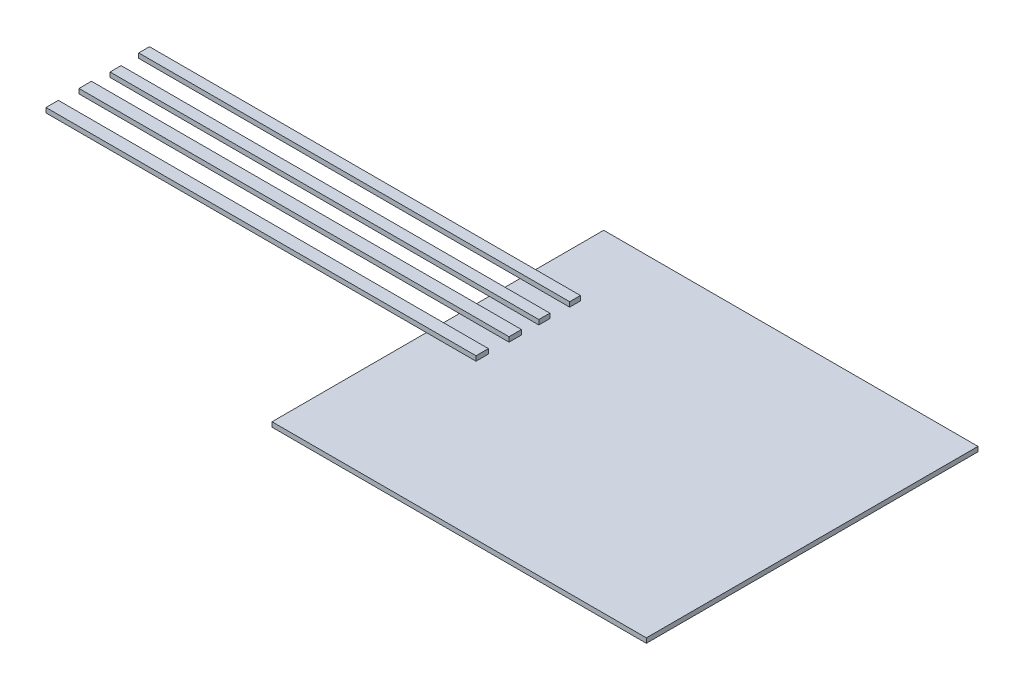
ISO-10303-21;
HEADER;
FILE_DESCRIPTION(('STEP AP214'),'2;1');
FILE_NAME('part.step','',(''),(''),'','','');
FILE_SCHEMA(('AUTOMOTIVE_DESIGN { 1 0 10303 214 1 1 1 1 }'));
ENDSEC;
DATA;
#1=APPLICATION_CONTEXT('core data for automotive mechanical design processes');
#2=APPLICATION_PROTOCOL_DEFINITION('international standard','automotive_design',2000,#1);
#3=PRODUCT_CONTEXT('',#1,'mechanical');
#4=PRODUCT('Part','Part','',(#3));
#5=PRODUCT_RELATED_PRODUCT_CATEGORY('part','',(#4));
#6=PRODUCT_DEFINITION_FORMATION('','',#4);
#7=PRODUCT_DEFINITION_CONTEXT('part definition',#1,'design');
#8=PRODUCT_DEFINITION('design','',#6,#7);
#9=PRODUCT_DEFINITION_SHAPE('','',#8);
#10=(LENGTH_UNIT() NAMED_UNIT(*) SI_UNIT(.MILLI.,.METRE.));
#11=(NAMED_UNIT(*) PLANE_ANGLE_UNIT() SI_UNIT($,.RADIAN.));
#12=(NAMED_UNIT(*) SI_UNIT($,.STERADIAN.) SOLID_ANGLE_UNIT());
#13=UNCERTAINTY_MEASURE_WITH_UNIT(LENGTH_MEASURE(1.E-05),#10,'distance_accuracy_value','');
#14=(GEOMETRIC_REPRESENTATION_CONTEXT(3) GLOBAL_UNCERTAINTY_ASSIGNED_CONTEXT((#13)) GLOBAL_UNIT_ASSIGNED_CONTEXT((#10,
#11,#12)) REPRESENTATION_CONTEXT('',''));
#15=CARTESIAN_POINT('',(0.,0.,0.));
#16=DIRECTION('',(0.,0.,1.));
#17=DIRECTION('',(1.,0.,0.));
#18=AXIS2_PLACEMENT_3D('',#15,#16,#17);
#19=CARTESIAN_POINT('',(-39.9859665766938,0.5,12.9830018030511));
#20=DIRECTION('',(0.,1.,0.));
#21=DIRECTION('',(0.,0.,1.));
#22=AXIS2_PLACEMENT_3D('',#19,#20,#21);
#23=PLANE('',#22);
#24=DIRECTION('',(0.,0.,1.));
#25=VECTOR('',#24,1.);
#26=CARTESIAN_POINT('',(-39.9859665766938,0.5,-22.0169981969489));
#27=LINE('',#26,#25);
#28=CARTESIAN_POINT('',(-39.9859665766938,0.5,-22.0169981969489));
#29=VERTEX_POINT('',#28);
#30=CARTESIAN_POINT('',(-39.9859665766938,0.5,-14.3264205111031));
#31=VERTEX_POINT('',#30);
#32=EDGE_CURVE('E320',#29,#31,#27,.T.);
#33=ORIENTED_EDGE('',*,*,#32,.T.);
#34=DIRECTION('',(-1.,0.,0.));
#35=VECTOR('',#34,1.);
#36=CARTESIAN_POINT('',(-34.7531592675171,0.5,-14.3264205111031));
#37=LINE('',#36,#35);
#38=CARTESIAN_POINT('',(-34.7531592675171,0.5,-14.3264205111031));
#39=VERTEX_POINT('',#38);
#40=EDGE_CURVE('E48',#39,#31,#37,.T.);
#41=ORIENTED_EDGE('',*,*,#40,.F.);
#42=DIRECTION('',(0.,0.,-1.));
#43=VECTOR('',#42,1.);
#44=CARTESIAN_POINT('',(-34.7531592675171,0.5,-13.1931519670227));
#45=LINE('',#44,#43);
#46=CARTESIAN_POINT('',(-34.7531592675171,0.5,-13.1931519670227));
#47=VERTEX_POINT('',#46);
#48=EDGE_CURVE('E53',#47,#39,#45,.T.);
#49=ORIENTED_EDGE('',*,*,#48,.F.);
#50=DIRECTION('',(1.,0.,0.));
#51=VECTOR('',#50,1.);
#52=CARTESIAN_POINT('',(-34.7531592675171,0.5,-13.1931519670227));
#53=LINE('',#52,#51);
#54=CARTESIAN_POINT('',(-39.9859665766938,0.5,-13.1931519670227));
#55=VERTEX_POINT('',#54);
#56=EDGE_CURVE('E396',#55,#47,#53,.T.);
#57=ORIENTED_EDGE('',*,*,#56,.F.);
#58=CARTESIAN_POINT('',(-39.9859665766938,0.5,-11.1012194312207));
#59=VERTEX_POINT('',#58);
#60=EDGE_CURVE('E324',#55,#59,#27,.T.);
#61=ORIENTED_EDGE('',*,*,#60,.T.);
#62=DIRECTION('',(-1.,0.,0.));
#63=VECTOR('',#62,1.);
#64=CARTESIAN_POINT('',(-34.7531592675171,0.5,-11.1012194312207));
#65=LINE('',#64,#63);
#66=CARTESIAN_POINT('',(-34.7531592675171,0.5,-11.1012194312207));
#67=VERTEX_POINT('',#66);
#68=EDGE_CURVE('E236',#67,#59,#65,.T.);
#69=ORIENTED_EDGE('',*,*,#68,.F.);
#70=DIRECTION('',(0.,0.,-1.));
#71=VECTOR('',#70,1.);
#72=CARTESIAN_POINT('',(-34.7531592675171,0.5,-9.93720931208993));
#73=LINE('',#72,#71);
#74=CARTESIAN_POINT('',(-34.7531592675171,0.5,-9.93720931208993));
#75=VERTEX_POINT('',#74);
#76=EDGE_CURVE('E216',#75,#67,#73,.T.);
#77=ORIENTED_EDGE('',*,*,#76,.F.);
#78=DIRECTION('',(1.,0.,0.));
#79=VECTOR('',#78,1.);
#80=CARTESIAN_POINT('',(-34.7531592675171,0.5,-9.93720931208993));
#81=LINE('',#80,#79);
#82=CARTESIAN_POINT('',(-39.9859665766938,0.5,-9.93720931208993));
#83=VERTEX_POINT('',#82);
#84=EDGE_CURVE('E241',#83,#75,#81,.T.);
#85=ORIENTED_EDGE('',*,*,#84,.F.);
#86=CARTESIAN_POINT('',(-39.9859665766938,0.5,-8.10820128942376));
#87=VERTEX_POINT('',#86);
#88=EDGE_CURVE('E382',#83,#87,#27,.T.);
#89=ORIENTED_EDGE('',*,*,#88,.T.);
#90=DIRECTION('',(-1.,0.,0.));
#91=VECTOR('',#90,1.);
#92=CARTESIAN_POINT('',(-34.7531592675171,0.5,-8.10820128942376));
#93=LINE('',#92,#91);
#94=CARTESIAN_POINT('',(-34.7531592675171,0.5,-8.10820128942376));
#95=VERTEX_POINT('',#94);
#96=EDGE_CURVE('E270',#95,#87,#93,.T.);
#97=ORIENTED_EDGE('',*,*,#96,.F.);
#98=DIRECTION('',(0.,0.,-1.));
#99=VECTOR('',#98,1.);
#100=CARTESIAN_POINT('',(-34.7531592675171,0.5,-6.79325301199736));
#101=LINE('',#100,#99);
#102=CARTESIAN_POINT('',(-34.7531592675171,0.5,-6.79325301199736));
#103=VERTEX_POINT('',#102);
#104=EDGE_CURVE('E255',#103,#95,#101,.T.);
#105=ORIENTED_EDGE('',*,*,#104,.F.);
#106=DIRECTION('',(-1.,0.,0.));
#107=VECTOR('',#106,1.);
#108=CARTESIAN_POINT('',(-39.9859665766938,0.5,-6.79325301199736));
#109=LINE('',#108,#107);
#110=CARTESIAN_POINT('',(-39.9859665766938,0.5,-6.79325301199736));
#111=VERTEX_POINT('',#110);
#112=EDGE_CURVE('E11',#103,#111,#109,.T.);
#113=ORIENTED_EDGE('',*,*,#112,.T.);
#114=CARTESIAN_POINT('',(-39.9859665766938,0.5,-4.61650701533452));
#115=VERTEX_POINT('',#114);
#116=EDGE_CURVE('E378',#111,#115,#27,.T.);
#117=ORIENTED_EDGE('',*,*,#116,.T.);
#118=DIRECTION('',(-1.,0.,0.));
#119=VECTOR('',#118,1.);
#120=CARTESIAN_POINT('',(-34.7531592675171,0.5,-4.61650701533452));
#121=LINE('',#120,#119);
#122=CARTESIAN_POINT('',(-34.7531592675171,0.5,-4.61650701533452));
#123=VERTEX_POINT('',#122);
#124=EDGE_CURVE('E301',#123,#115,#121,.T.);
#125=ORIENTED_EDGE('',*,*,#124,.F.);
#126=DIRECTION('',(0.,0.,-1.));
#127=VECTOR('',#126,1.);
#128=CARTESIAN_POINT('',(-34.7531592675171,0.5,-3.31076498617429));
#129=LINE('',#128,#127);
#130=CARTESIAN_POINT('',(-34.7531592675171,0.5,-3.31076498617429));
#131=VERTEX_POINT('',#130);
#132=EDGE_CURVE('E286',#131,#123,#129,.T.);
#133=ORIENTED_EDGE('',*,*,#132,.F.);
#134=DIRECTION('',(1.,0.,0.));
#135=VECTOR('',#134,1.);
#136=CARTESIAN_POINT('',(-34.7531592675171,0.5,-3.31076498617429));
#137=LINE('',#136,#135);
#138=CARTESIAN_POINT('',(-39.9859665766938,0.5,-3.31076498617429));
#139=VERTEX_POINT('',#138);
#140=EDGE_CURVE('E41',#139,#131,#137,.T.);
#141=ORIENTED_EDGE('',*,*,#140,.F.);
#142=CARTESIAN_POINT('',(-39.9859665766938,0.5,12.9830018030511));
#143=VERTEX_POINT('',#142);
#144=EDGE_CURVE('E340',#139,#143,#27,.T.);
#145=ORIENTED_EDGE('',*,*,#144,.T.);
#146=DIRECTION('',(1.,0.,0.));
#147=VECTOR('',#146,1.);
#148=CARTESIAN_POINT('',(-39.9859665766938,0.5,12.9830018030511));
#149=LINE('',#148,#147);
#150=CARTESIAN_POINT('',(-0.485966576693794,0.5,12.9830018030511));
#151=VERTEX_POINT('',#150);
#152=EDGE_CURVE('E322',#143,#151,#149,.T.);
#153=ORIENTED_EDGE('',*,*,#152,.T.);
#154=DIRECTION('',(0.,0.,-1.));
#155=VECTOR('',#154,1.);
#156=CARTESIAN_POINT('',(-0.485966576693801,0.5,-22.0169981969489));
#157=LINE('',#156,#155);
#158=CARTESIAN_POINT('',(-0.485966576693801,0.5,-22.0169981969489));
#159=VERTEX_POINT('',#158);
#160=EDGE_CURVE('E327',#151,#159,#157,.T.);
#161=ORIENTED_EDGE('',*,*,#160,.T.);
#162=DIRECTION('',(-1.,0.,0.));
#163=VECTOR('',#162,1.);
#164=CARTESIAN_POINT('',(-39.9859665766938,0.5,-22.0169981969489));
#165=LINE('',#164,#163);
#166=EDGE_CURVE('E329',#159,#29,#165,.T.);
#167=ORIENTED_EDGE('',*,*,#166,.T.);
#168=EDGE_LOOP('',(#33,#41,#49,#57,#61,#69,#77,#85,#89,#97,#105,#113,#117,#125,#133,#141,#145,
#153,#161,#167));
#169=FACE_BOUND('',#168,.T.);
#170=ADVANCED_FACE('F33',(#169),#23,.T.);
#171=CARTESIAN_POINT('',(-39.9859665766938,0.5,-22.0169981969489));
#172=DIRECTION('',(1.,0.,0.));
#173=DIRECTION('',(0.,0.,-1.));
#174=AXIS2_PLACEMENT_3D('',#171,#172,#173);
#175=PLANE('',#174);
#176=DIRECTION('',(0.,0.,1.));
#177=VECTOR('',#176,1.);
#178=CARTESIAN_POINT('',(-39.9859665766938,0.,-22.0169981969489));
#179=LINE('',#178,#177);
#180=CARTESIAN_POINT('',(-39.9859665766938,0.,-22.0169981969489));
#181=VERTEX_POINT('',#180);
#182=CARTESIAN_POINT('',(-39.9859665766938,0.,12.9830018030511));
#183=VERTEX_POINT('',#182);
#184=EDGE_CURVE('E319',#181,#183,#179,.T.);
#185=ORIENTED_EDGE('',*,*,#184,.T.);
#186=DIRECTION('',(0.,-1.,0.));
#187=VECTOR('',#186,1.);
#188=CARTESIAN_POINT('',(-39.9859665766938,0.5,12.9830018030511));
#189=LINE('',#188,#187);
#190=EDGE_CURVE('E348',#143,#183,#189,.T.);
#191=ORIENTED_EDGE('',*,*,#190,.F.);
#192=ORIENTED_EDGE('',*,*,#144,.F.);
#193=EDGE_CURVE('E325',#115,#139,#27,.T.);
#194=ORIENTED_EDGE('',*,*,#193,.F.);
#195=ORIENTED_EDGE('',*,*,#116,.F.);
#196=EDGE_CURVE('E379',#87,#111,#27,.T.);
#197=ORIENTED_EDGE('',*,*,#196,.F.);
#198=ORIENTED_EDGE('',*,*,#88,.F.);
#199=EDGE_CURVE('E380',#59,#83,#27,.T.);
#200=ORIENTED_EDGE('',*,*,#199,.F.);
#201=ORIENTED_EDGE('',*,*,#60,.F.);
#202=EDGE_CURVE('E323',#31,#55,#27,.T.);
#203=ORIENTED_EDGE('',*,*,#202,.F.);
#204=ORIENTED_EDGE('',*,*,#32,.F.);
#205=DIRECTION('',(0.,-1.,0.));
#206=VECTOR('',#205,1.);
#207=CARTESIAN_POINT('',(-39.9859665766938,0.5,-22.0169981969489));
#208=LINE('',#207,#206);
#209=EDGE_CURVE('E331',#29,#181,#208,.T.);
#210=ORIENTED_EDGE('',*,*,#209,.T.);
#211=EDGE_LOOP('',(#185,#191,#192,#194,#195,#197,#198,#200,#201,#203,#204,#210));
#212=FACE_BOUND('',#211,.T.);
#213=ADVANCED_FACE('F35',(#212),#175,.F.);
#214=CARTESIAN_POINT('',(-39.9859665766938,0.5,12.9830018030511));
#215=DIRECTION('',(0.,0.,-1.));
#216=DIRECTION('',(-1.,0.,0.));
#217=AXIS2_PLACEMENT_3D('',#214,#215,#216);
#218=PLANE('',#217);
#219=DIRECTION('',(1.,0.,0.));
#220=VECTOR('',#219,1.);
#221=CARTESIAN_POINT('',(-39.9859665766938,0.,12.9830018030511));
#222=LINE('',#221,#220);
#223=CARTESIAN_POINT('',(-0.485966576693794,0.,12.9830018030511));
#224=VERTEX_POINT('',#223);
#225=EDGE_CURVE('E334',#183,#224,#222,.T.);
#226=ORIENTED_EDGE('',*,*,#225,.T.);
#227=DIRECTION('',(0.,-1.,0.));
#228=VECTOR('',#227,1.);
#229=CARTESIAN_POINT('',(-0.485966576693794,0.5,12.9830018030511));
#230=LINE('',#229,#228);
#231=EDGE_CURVE('E346',#151,#224,#230,.T.);
#232=ORIENTED_EDGE('',*,*,#231,.F.);
#233=ORIENTED_EDGE('',*,*,#152,.F.);
#234=ORIENTED_EDGE('',*,*,#190,.T.);
#235=EDGE_LOOP('',(#226,#232,#233,#234));
#236=FACE_BOUND('',#235,.T.);
#237=ADVANCED_FACE('F436',(#236),#218,.F.);
#238=CARTESIAN_POINT('',(-0.485966576693801,0.5,-22.0169981969489));
#239=DIRECTION('',(-1.,0.,0.));
#240=DIRECTION('',(0.,0.,1.));
#241=AXIS2_PLACEMENT_3D('',#238,#239,#240);
#242=PLANE('',#241);
#243=DIRECTION('',(0.,0.,-1.));
#244=VECTOR('',#243,1.);
#245=CARTESIAN_POINT('',(-0.485966576693801,0.,-22.0169981969489));
#246=LINE('',#245,#244);
#247=CARTESIAN_POINT('',(-0.485966576693801,0.,-22.0169981969489));
#248=VERTEX_POINT('',#247);
#249=EDGE_CURVE('E336',#224,#248,#246,.T.);
#250=ORIENTED_EDGE('',*,*,#249,.T.);
#251=DIRECTION('',(0.,-1.,0.));
#252=VECTOR('',#251,1.);
#253=CARTESIAN_POINT('',(-0.485966576693801,0.5,-22.0169981969489));
#254=LINE('',#253,#252);
#255=EDGE_CURVE('E343',#159,#248,#254,.T.);
#256=ORIENTED_EDGE('',*,*,#255,.F.);
#257=ORIENTED_EDGE('',*,*,#160,.F.);
#258=ORIENTED_EDGE('',*,*,#231,.T.);
#259=EDGE_LOOP('',(#250,#256,#257,#258));
#260=FACE_BOUND('',#259,.T.);
#261=ADVANCED_FACE('F447',(#260),#242,.F.);
#262=CARTESIAN_POINT('',(-39.9859665766938,0.5,-22.0169981969489));
#263=DIRECTION('',(0.,0.,1.));
#264=DIRECTION('',(1.,0.,0.));
#265=AXIS2_PLACEMENT_3D('',#262,#263,#264);
#266=PLANE('',#265);
#267=DIRECTION('',(-1.,0.,0.));
#268=VECTOR('',#267,1.);
#269=CARTESIAN_POINT('',(-39.9859665766938,0.,-22.0169981969489));
#270=LINE('',#269,#268);
#271=EDGE_CURVE('E338',#248,#181,#270,.T.);
#272=ORIENTED_EDGE('',*,*,#271,.T.);
#273=ORIENTED_EDGE('',*,*,#209,.F.);
#274=ORIENTED_EDGE('',*,*,#166,.F.);
#275=ORIENTED_EDGE('',*,*,#255,.T.);
#276=EDGE_LOOP('',(#272,#273,#274,#275));
#277=FACE_BOUND('',#276,.T.);
#278=ADVANCED_FACE('F443',(#277),#266,.F.);
#279=CARTESIAN_POINT('',(-39.9859665766938,0.,12.9830018030511));
#280=DIRECTION('',(0.,1.,0.));
#281=DIRECTION('',(0.,0.,1.));
#282=AXIS2_PLACEMENT_3D('',#279,#280,#281);
#283=PLANE('',#282);
#284=ORIENTED_EDGE('',*,*,#184,.F.);
#285=ORIENTED_EDGE('',*,*,#271,.F.);
#286=ORIENTED_EDGE('',*,*,#249,.F.);
#287=ORIENTED_EDGE('',*,*,#225,.F.);
#288=EDGE_LOOP('',(#284,#285,#286,#287));
#289=FACE_BOUND('',#288,.T.);
#290=ADVANCED_FACE('F440',(#289),#283,.F.);
#291=CARTESIAN_POINT('',(-34.7531592675171,0.5,-4.61650701533452));
#292=DIRECTION('',(0.,1.,0.));
#293=DIRECTION('',(0.,0.,1.));
#294=AXIS2_PLACEMENT_3D('',#291,#292,#293);
#295=PLANE('',#294);
#296=CARTESIAN_POINT('',(-80.132685875428,0.5,-4.61650701533452));
#297=VERTEX_POINT('',#296);
#298=EDGE_CURVE('E300',#115,#297,#121,.T.);
#299=ORIENTED_EDGE('',*,*,#298,.F.);
#300=ORIENTED_EDGE('',*,*,#193,.T.);
#301=CARTESIAN_POINT('',(-80.132685875428,0.5,-3.31076498617429));
#302=VERTEX_POINT('',#301);
#303=EDGE_CURVE('E291',#302,#139,#137,.T.);
#304=ORIENTED_EDGE('',*,*,#303,.F.);
#305=DIRECTION('',(0.,0.,1.));
#306=VECTOR('',#305,1.);
#307=CARTESIAN_POINT('',(-80.132685875428,0.5,-3.31076498617429));
#308=LINE('',#307,#306);
#309=EDGE_CURVE('E304',#297,#302,#308,.T.);
#310=ORIENTED_EDGE('',*,*,#309,.F.);
#311=EDGE_LOOP('',(#299,#300,#304,#310));
#312=FACE_BOUND('',#311,.T.);
#313=ADVANCED_FACE('F374',(#312),#295,.F.);
#314=CARTESIAN_POINT('',(-34.7531592675171,1.,-3.31076498617429));
#315=DIRECTION('',(-1.,0.,0.));
#316=DIRECTION('',(0.,0.,1.));
#317=AXIS2_PLACEMENT_3D('',#314,#315,#316);
#318=PLANE('',#317);
#319=ORIENTED_EDGE('',*,*,#132,.T.);
#320=DIRECTION('',(0.,-1.,0.));
#321=VECTOR('',#320,1.);
#322=CARTESIAN_POINT('',(-34.7531592675171,1.,-4.61650701533452));
#323=LINE('',#322,#321);
#324=CARTESIAN_POINT('',(-34.7531592675171,1.,-4.61650701533452));
#325=VERTEX_POINT('',#324);
#326=EDGE_CURVE('E316',#325,#123,#323,.T.);
#327=ORIENTED_EDGE('',*,*,#326,.F.);
#328=DIRECTION('',(0.,0.,-1.));
#329=VECTOR('',#328,1.);
#330=CARTESIAN_POINT('',(-34.7531592675171,1.,-3.31076498617429));
#331=LINE('',#330,#329);
#332=CARTESIAN_POINT('',(-34.7531592675171,1.,-3.31076498617429));
#333=VERTEX_POINT('',#332);
#334=EDGE_CURVE('E287',#333,#325,#331,.T.);
#335=ORIENTED_EDGE('',*,*,#334,.F.);
#336=DIRECTION('',(0.,-1.,0.));
#337=VECTOR('',#336,1.);
#338=CARTESIAN_POINT('',(-34.7531592675171,1.,-3.31076498617429));
#339=LINE('',#338,#337);
#340=EDGE_CURVE('E297',#333,#131,#339,.T.);
#341=ORIENTED_EDGE('',*,*,#340,.T.);
#342=EDGE_LOOP('',(#319,#327,#335,#341));
#343=FACE_BOUND('',#342,.T.);
#344=ADVANCED_FACE('F362',(#343),#318,.F.);
#345=CARTESIAN_POINT('',(-34.7531592675171,1.,-4.61650701533452));
#346=DIRECTION('',(0.,0.,1.));
#347=DIRECTION('',(1.,0.,0.));
#348=AXIS2_PLACEMENT_3D('',#345,#346,#347);
#349=PLANE('',#348);
#350=ORIENTED_EDGE('',*,*,#124,.T.);
#351=ORIENTED_EDGE('',*,*,#298,.T.);
#352=DIRECTION('',(0.,-1.,0.));
#353=VECTOR('',#352,1.);
#354=CARTESIAN_POINT('',(-80.132685875428,1.,-4.61650701533452));
#355=LINE('',#354,#353);
#356=CARTESIAN_POINT('',(-80.132685875428,1.,-4.61650701533452));
#357=VERTEX_POINT('',#356);
#358=EDGE_CURVE('E313',#357,#297,#355,.T.);
#359=ORIENTED_EDGE('',*,*,#358,.F.);
#360=DIRECTION('',(-1.,0.,0.));
#361=VECTOR('',#360,1.);
#362=CARTESIAN_POINT('',(-34.7531592675171,1.,-4.61650701533452));
#363=LINE('',#362,#361);
#364=EDGE_CURVE('E290',#325,#357,#363,.T.);
#365=ORIENTED_EDGE('',*,*,#364,.F.);
#366=ORIENTED_EDGE('',*,*,#326,.T.);
#367=EDGE_LOOP('',(#350,#351,#359,#365,#366));
#368=FACE_BOUND('',#367,.T.);
#369=ADVANCED_FACE('F635',(#368),#349,.F.);
#370=CARTESIAN_POINT('',(-80.132685875428,1.,-3.31076498617429));
#371=DIRECTION('',(1.,0.,0.));
#372=DIRECTION('',(0.,0.,-1.));
#373=AXIS2_PLACEMENT_3D('',#370,#371,#372);
#374=PLANE('',#373);
#375=ORIENTED_EDGE('',*,*,#309,.T.);
#376=DIRECTION('',(0.,-1.,0.));
#377=VECTOR('',#376,1.);
#378=CARTESIAN_POINT('',(-80.132685875428,1.,-3.31076498617429));
#379=LINE('',#378,#377);
#380=CARTESIAN_POINT('',(-80.132685875428,1.,-3.31076498617429));
#381=VERTEX_POINT('',#380);
#382=EDGE_CURVE('E310',#381,#302,#379,.T.);
#383=ORIENTED_EDGE('',*,*,#382,.F.);
#384=DIRECTION('',(0.,0.,1.));
#385=VECTOR('',#384,1.);
#386=CARTESIAN_POINT('',(-80.132685875428,1.,-3.31076498617429));
#387=LINE('',#386,#385);
#388=EDGE_CURVE('E293',#357,#381,#387,.T.);
#389=ORIENTED_EDGE('',*,*,#388,.F.);
#390=ORIENTED_EDGE('',*,*,#358,.T.);
#391=EDGE_LOOP('',(#375,#383,#389,#390));
#392=FACE_BOUND('',#391,.T.);
#393=ADVANCED_FACE('F627',(#392),#374,.F.);
#394=CARTESIAN_POINT('',(-34.7531592675171,1.,-3.31076498617429));
#395=DIRECTION('',(0.,0.,-1.));
#396=DIRECTION('',(-1.,0.,0.));
#397=AXIS2_PLACEMENT_3D('',#394,#395,#396);
#398=PLANE('',#397);
#399=ORIENTED_EDGE('',*,*,#303,.T.);
#400=ORIENTED_EDGE('',*,*,#140,.T.);
#401=ORIENTED_EDGE('',*,*,#340,.F.);
#402=DIRECTION('',(1.,0.,0.));
#403=VECTOR('',#402,1.);
#404=CARTESIAN_POINT('',(-34.7531592675171,1.,-3.31076498617429));
#405=LINE('',#404,#403);
#406=EDGE_CURVE('E295',#381,#333,#405,.T.);
#407=ORIENTED_EDGE('',*,*,#406,.F.);
#408=ORIENTED_EDGE('',*,*,#382,.T.);
#409=EDGE_LOOP('',(#399,#400,#401,#407,#408));
#410=FACE_BOUND('',#409,.T.);
#411=ADVANCED_FACE('F356',(#410),#398,.F.);
#412=CARTESIAN_POINT('',(-34.7531592675171,1.,-4.61650701533452));
#413=DIRECTION('',(0.,1.,0.));
#414=DIRECTION('',(0.,0.,1.));
#415=AXIS2_PLACEMENT_3D('',#412,#413,#414);
#416=PLANE('',#415);
#417=ORIENTED_EDGE('',*,*,#334,.T.);
#418=ORIENTED_EDGE('',*,*,#364,.T.);
#419=ORIENTED_EDGE('',*,*,#388,.T.);
#420=ORIENTED_EDGE('',*,*,#406,.T.);
#421=EDGE_LOOP('',(#417,#418,#419,#420));
#422=FACE_BOUND('',#421,.T.);
#423=ADVANCED_FACE('F365',(#422),#416,.T.);
#424=CARTESIAN_POINT('',(-34.7531592675171,0.5,-8.10820128942376));
#425=DIRECTION('',(0.,1.,0.));
#426=DIRECTION('',(0.,0.,1.));
#427=AXIS2_PLACEMENT_3D('',#424,#425,#426);
#428=PLANE('',#427);
#429=CARTESIAN_POINT('',(-80.132685875428,0.5,-8.10820128942376));
#430=VERTEX_POINT('',#429);
#431=EDGE_CURVE('E269',#87,#430,#93,.T.);
#432=ORIENTED_EDGE('',*,*,#431,.F.);
#433=ORIENTED_EDGE('',*,*,#196,.T.);
#434=DIRECTION('',(1.,0.,0.));
#435=VECTOR('',#434,1.);
#436=CARTESIAN_POINT('',(-34.7531592675171,0.5,-6.79325301199736));
#437=LINE('',#436,#435);
#438=CARTESIAN_POINT('',(-80.132685875428,0.5,-6.79325301199736));
#439=VERTEX_POINT('',#438);
#440=EDGE_CURVE('E260',#439,#111,#437,.T.);
#441=ORIENTED_EDGE('',*,*,#440,.F.);
#442=DIRECTION('',(0.,0.,1.));
#443=VECTOR('',#442,1.);
#444=CARTESIAN_POINT('',(-80.132685875428,0.5,-6.79325301199736));
#445=LINE('',#444,#443);
#446=EDGE_CURVE('E273',#430,#439,#445,.T.);
#447=ORIENTED_EDGE('',*,*,#446,.F.);
#448=EDGE_LOOP('',(#432,#433,#441,#447));
#449=FACE_BOUND('',#448,.T.);
#450=ADVANCED_FACE('F604',(#449),#428,.F.);
#451=CARTESIAN_POINT('',(-34.7531592675171,1.,-6.79325301199736));
#452=DIRECTION('',(-1.,0.,0.));
#453=DIRECTION('',(0.,0.,1.));
#454=AXIS2_PLACEMENT_3D('',#451,#452,#453);
#455=PLANE('',#454);
#456=ORIENTED_EDGE('',*,*,#104,.T.);
#457=DIRECTION('',(0.,-1.,0.));
#458=VECTOR('',#457,1.);
#459=CARTESIAN_POINT('',(-34.7531592675171,1.,-8.10820128942376));
#460=LINE('',#459,#458);
#461=CARTESIAN_POINT('',(-34.7531592675171,1.,-8.10820128942376));
#462=VERTEX_POINT('',#461);
#463=EDGE_CURVE('E284',#462,#95,#460,.T.);
#464=ORIENTED_EDGE('',*,*,#463,.F.);
#465=DIRECTION('',(0.,0.,-1.));
#466=VECTOR('',#465,1.);
#467=CARTESIAN_POINT('',(-34.7531592675171,1.,-6.79325301199736));
#468=LINE('',#467,#466);
#469=CARTESIAN_POINT('',(-34.7531592675171,1.,-6.79325301199736));
#470=VERTEX_POINT('',#469);
#471=EDGE_CURVE('E256',#470,#462,#468,.T.);
#472=ORIENTED_EDGE('',*,*,#471,.F.);
#473=DIRECTION('',(0.,-1.,0.));
#474=VECTOR('',#473,1.);
#475=CARTESIAN_POINT('',(-34.7531592675171,1.,-6.79325301199736));
#476=LINE('',#475,#474);
#477=EDGE_CURVE('E266',#470,#103,#476,.T.);
#478=ORIENTED_EDGE('',*,*,#477,.T.);
#479=EDGE_LOOP('',(#456,#464,#472,#478));
#480=FACE_BOUND('',#479,.T.);
#481=ADVANCED_FACE('F595',(#480),#455,.F.);
#482=CARTESIAN_POINT('',(-34.7531592675171,1.,-8.10820128942376));
#483=DIRECTION('',(0.,0.,1.));
#484=DIRECTION('',(1.,0.,0.));
#485=AXIS2_PLACEMENT_3D('',#482,#483,#484);
#486=PLANE('',#485);
#487=ORIENTED_EDGE('',*,*,#96,.T.);
#488=ORIENTED_EDGE('',*,*,#431,.T.);
#489=DIRECTION('',(0.,-1.,0.));
#490=VECTOR('',#489,1.);
#491=CARTESIAN_POINT('',(-80.132685875428,1.,-8.10820128942376));
#492=LINE('',#491,#490);
#493=CARTESIAN_POINT('',(-80.132685875428,1.,-8.10820128942376));
#494=VERTEX_POINT('',#493);
#495=EDGE_CURVE('E281',#494,#430,#492,.T.);
#496=ORIENTED_EDGE('',*,*,#495,.F.);
#497=DIRECTION('',(-1.,0.,0.));
#498=VECTOR('',#497,1.);
#499=CARTESIAN_POINT('',(-34.7531592675171,1.,-8.10820128942376));
#500=LINE('',#499,#498);
#501=EDGE_CURVE('E259',#462,#494,#500,.T.);
#502=ORIENTED_EDGE('',*,*,#501,.F.);
#503=ORIENTED_EDGE('',*,*,#463,.T.);
#504=EDGE_LOOP('',(#487,#488,#496,#502,#503));
#505=FACE_BOUND('',#504,.T.);
#506=ADVANCED_FACE('F586',(#505),#486,.F.);
#507=CARTESIAN_POINT('',(-80.132685875428,1.,-6.79325301199736));
#508=DIRECTION('',(1.,0.,0.));
#509=DIRECTION('',(0.,0.,-1.));
#510=AXIS2_PLACEMENT_3D('',#507,#508,#509);
#511=PLANE('',#510);
#512=ORIENTED_EDGE('',*,*,#446,.T.);
#513=DIRECTION('',(0.,-1.,0.));
#514=VECTOR('',#513,1.);
#515=CARTESIAN_POINT('',(-80.132685875428,1.,-6.79325301199736));
#516=LINE('',#515,#514);
#517=CARTESIAN_POINT('',(-80.132685875428,1.,-6.79325301199736));
#518=VERTEX_POINT('',#517);
#519=EDGE_CURVE('E278',#518,#439,#516,.T.);
#520=ORIENTED_EDGE('',*,*,#519,.F.);
#521=DIRECTION('',(0.,0.,1.));
#522=VECTOR('',#521,1.);
#523=CARTESIAN_POINT('',(-80.132685875428,1.,-6.79325301199736));
#524=LINE('',#523,#522);
#525=EDGE_CURVE('E262',#494,#518,#524,.T.);
#526=ORIENTED_EDGE('',*,*,#525,.F.);
#527=ORIENTED_EDGE('',*,*,#495,.T.);
#528=EDGE_LOOP('',(#512,#520,#526,#527));
#529=FACE_BOUND('',#528,.T.);
#530=ADVANCED_FACE('F577',(#529),#511,.F.);
#531=CARTESIAN_POINT('',(-34.7531592675171,1.,-6.79325301199736));
#532=DIRECTION('',(0.,0.,-1.));
#533=DIRECTION('',(-1.,0.,0.));
#534=AXIS2_PLACEMENT_3D('',#531,#532,#533);
#535=PLANE('',#534);
#536=ORIENTED_EDGE('',*,*,#440,.T.);
#537=ORIENTED_EDGE('',*,*,#112,.F.);
#538=ORIENTED_EDGE('',*,*,#477,.F.);
#539=DIRECTION('',(1.,0.,0.));
#540=VECTOR('',#539,1.);
#541=CARTESIAN_POINT('',(-34.7531592675171,1.,-6.79325301199736));
#542=LINE('',#541,#540);
#543=EDGE_CURVE('E264',#518,#470,#542,.T.);
#544=ORIENTED_EDGE('',*,*,#543,.F.);
#545=ORIENTED_EDGE('',*,*,#519,.T.);
#546=EDGE_LOOP('',(#536,#537,#538,#544,#545));
#547=FACE_BOUND('',#546,.T.);
#548=ADVANCED_FACE('F568',(#547),#535,.F.);
#549=CARTESIAN_POINT('',(-34.7531592675171,1.,-8.10820128942376));
#550=DIRECTION('',(0.,1.,0.));
#551=DIRECTION('',(0.,0.,1.));
#552=AXIS2_PLACEMENT_3D('',#549,#550,#551);
#553=PLANE('',#552);
#554=ORIENTED_EDGE('',*,*,#471,.T.);
#555=ORIENTED_EDGE('',*,*,#501,.T.);
#556=ORIENTED_EDGE('',*,*,#525,.T.);
#557=ORIENTED_EDGE('',*,*,#543,.T.);
#558=EDGE_LOOP('',(#554,#555,#556,#557));
#559=FACE_BOUND('',#558,.T.);
#560=ADVANCED_FACE('F561',(#559),#553,.T.);
#561=CARTESIAN_POINT('',(-34.7531592675171,0.5,-11.1012194312207));
#562=DIRECTION('',(0.,1.,0.));
#563=DIRECTION('',(0.,0.,1.));
#564=AXIS2_PLACEMENT_3D('',#561,#562,#563);
#565=PLANE('',#564);
#566=CARTESIAN_POINT('',(-80.0008549548301,0.5,-11.1012194312207));
#567=VERTEX_POINT('',#566);
#568=EDGE_CURVE('E219',#59,#567,#65,.T.);
#569=ORIENTED_EDGE('',*,*,#568,.F.);
#570=ORIENTED_EDGE('',*,*,#199,.T.);
#571=CARTESIAN_POINT('',(-80.0008549548301,0.5,-9.93720931208993));
#572=VERTEX_POINT('',#571);
#573=EDGE_CURVE('E229',#572,#83,#81,.T.);
#574=ORIENTED_EDGE('',*,*,#573,.F.);
#575=DIRECTION('',(0.,0.,1.));
#576=VECTOR('',#575,1.);
#577=CARTESIAN_POINT('',(-80.0008549548301,0.5,-9.93720931208993));
#578=LINE('',#577,#576);
#579=EDGE_CURVE('E239',#567,#572,#578,.T.);
#580=ORIENTED_EDGE('',*,*,#579,.F.);
#581=EDGE_LOOP('',(#569,#570,#574,#580));
#582=FACE_BOUND('',#581,.T.);
#583=ADVANCED_FACE('F401',(#582),#565,.F.);
#584=CARTESIAN_POINT('',(-34.7531592675171,1.,-9.93720931208993));
#585=DIRECTION('',(-1.,0.,0.));
#586=DIRECTION('',(0.,0.,1.));
#587=AXIS2_PLACEMENT_3D('',#584,#585,#586);
#588=PLANE('',#587);
#589=ORIENTED_EDGE('',*,*,#76,.T.);
#590=DIRECTION('',(0.,-1.,0.));
#591=VECTOR('',#590,1.);
#592=CARTESIAN_POINT('',(-34.7531592675171,1.,-11.1012194312207));
#593=LINE('',#592,#591);
#594=CARTESIAN_POINT('',(-34.7531592675171,1.,-11.1012194312207));
#595=VERTEX_POINT('',#594);
#596=EDGE_CURVE('E252',#595,#67,#593,.T.);
#597=ORIENTED_EDGE('',*,*,#596,.F.);
#598=DIRECTION('',(0.,0.,-1.));
#599=VECTOR('',#598,1.);
#600=CARTESIAN_POINT('',(-34.7531592675171,1.,-9.93720931208993));
#601=LINE('',#600,#599);
#602=CARTESIAN_POINT('',(-34.7531592675171,1.,-9.93720931208993));
#603=VERTEX_POINT('',#602);
#604=EDGE_CURVE('E225',#603,#595,#601,.T.);
#605=ORIENTED_EDGE('',*,*,#604,.F.);
#606=DIRECTION('',(0.,-1.,0.));
#607=VECTOR('',#606,1.);
#608=CARTESIAN_POINT('',(-34.7531592675171,1.,-9.93720931208993));
#609=LINE('',#608,#607);
#610=EDGE_CURVE('E234',#603,#75,#609,.T.);
#611=ORIENTED_EDGE('',*,*,#610,.T.);
#612=EDGE_LOOP('',(#589,#597,#605,#611));
#613=FACE_BOUND('',#612,.T.);
#614=ADVANCED_FACE('F408',(#613),#588,.F.);
#615=CARTESIAN_POINT('',(-34.7531592675171,1.,-11.1012194312207));
#616=DIRECTION('',(0.,0.,1.));
#617=DIRECTION('',(1.,0.,0.));
#618=AXIS2_PLACEMENT_3D('',#615,#616,#617);
#619=PLANE('',#618);
#620=ORIENTED_EDGE('',*,*,#68,.T.);
#621=ORIENTED_EDGE('',*,*,#568,.T.);
#622=DIRECTION('',(0.,-1.,0.));
#623=VECTOR('',#622,1.);
#624=CARTESIAN_POINT('',(-80.0008549548301,1.,-11.1012194312207));
#625=LINE('',#624,#623);
#626=CARTESIAN_POINT('',(-80.0008549548301,1.,-11.1012194312207));
#627=VERTEX_POINT('',#626);
#628=EDGE_CURVE('E249',#627,#567,#625,.T.);
#629=ORIENTED_EDGE('',*,*,#628,.F.);
#630=DIRECTION('',(-1.,0.,0.));
#631=VECTOR('',#630,1.);
#632=CARTESIAN_POINT('',(-34.7531592675171,1.,-11.1012194312207));
#633=LINE('',#632,#631);
#634=EDGE_CURVE('E228',#595,#627,#633,.T.);
#635=ORIENTED_EDGE('',*,*,#634,.F.);
#636=ORIENTED_EDGE('',*,*,#596,.T.);
#637=EDGE_LOOP('',(#620,#621,#629,#635,#636));
#638=FACE_BOUND('',#637,.T.);
#639=ADVANCED_FACE('F404',(#638),#619,.F.);
#640=CARTESIAN_POINT('',(-80.0008549548301,1.,-9.93720931208993));
#641=DIRECTION('',(1.,0.,0.));
#642=DIRECTION('',(0.,0.,-1.));
#643=AXIS2_PLACEMENT_3D('',#640,#641,#642);
#644=PLANE('',#643);
#645=ORIENTED_EDGE('',*,*,#579,.T.);
#646=DIRECTION('',(0.,-1.,0.));
#647=VECTOR('',#646,1.);
#648=CARTESIAN_POINT('',(-80.0008549548301,1.,-9.93720931208993));
#649=LINE('',#648,#647);
#650=CARTESIAN_POINT('',(-80.0008549548301,1.,-9.93720931208993));
#651=VERTEX_POINT('',#650);
#652=EDGE_CURVE('E246',#651,#572,#649,.T.);
#653=ORIENTED_EDGE('',*,*,#652,.F.);
#654=DIRECTION('',(0.,0.,1.));
#655=VECTOR('',#654,1.);
#656=CARTESIAN_POINT('',(-80.0008549548301,1.,-9.93720931208993));
#657=LINE('',#656,#655);
#658=EDGE_CURVE('E231',#627,#651,#657,.T.);
#659=ORIENTED_EDGE('',*,*,#658,.F.);
#660=ORIENTED_EDGE('',*,*,#628,.T.);
#661=EDGE_LOOP('',(#645,#653,#659,#660));
#662=FACE_BOUND('',#661,.T.);
#663=ADVANCED_FACE('F417',(#662),#644,.F.);
#664=CARTESIAN_POINT('',(-34.7531592675171,1.,-9.93720931208993));
#665=DIRECTION('',(0.,0.,-1.));
#666=DIRECTION('',(-1.,0.,0.));
#667=AXIS2_PLACEMENT_3D('',#664,#665,#666);
#668=PLANE('',#667);
#669=ORIENTED_EDGE('',*,*,#573,.T.);
#670=ORIENTED_EDGE('',*,*,#84,.T.);
#671=ORIENTED_EDGE('',*,*,#610,.F.);
#672=DIRECTION('',(1.,0.,0.));
#673=VECTOR('',#672,1.);
#674=CARTESIAN_POINT('',(-34.7531592675171,1.,-9.93720931208993));
#675=LINE('',#674,#673);
#676=EDGE_CURVE('E233',#651,#603,#675,.T.);
#677=ORIENTED_EDGE('',*,*,#676,.F.);
#678=ORIENTED_EDGE('',*,*,#652,.T.);
#679=EDGE_LOOP('',(#669,#670,#671,#677,#678));
#680=FACE_BOUND('',#679,.T.);
#681=ADVANCED_FACE('F412',(#680),#668,.F.);
#682=CARTESIAN_POINT('',(-34.7531592675171,1.,-11.1012194312207));
#683=DIRECTION('',(0.,1.,0.));
#684=DIRECTION('',(0.,0.,1.));
#685=AXIS2_PLACEMENT_3D('',#682,#683,#684);
#686=PLANE('',#685);
#687=ORIENTED_EDGE('',*,*,#604,.T.);
#688=ORIENTED_EDGE('',*,*,#634,.T.);
#689=ORIENTED_EDGE('',*,*,#658,.T.);
#690=ORIENTED_EDGE('',*,*,#676,.T.);
#691=EDGE_LOOP('',(#687,#688,#689,#690));
#692=FACE_BOUND('',#691,.T.);
#693=ADVANCED_FACE('F419',(#692),#686,.T.);
#694=CARTESIAN_POINT('',(-34.7531592675171,0.5,-14.3264205111031));
#695=DIRECTION('',(0.,1.,0.));
#696=DIRECTION('',(0.,0.,1.));
#697=AXIS2_PLACEMENT_3D('',#694,#695,#696);
#698=PLANE('',#697);
#699=CARTESIAN_POINT('',(-80.2312264605359,0.5,-14.3264205111031));
#700=VERTEX_POINT('',#699);
#701=EDGE_CURVE('E464',#31,#700,#37,.T.);
#702=ORIENTED_EDGE('',*,*,#701,.F.);
#703=ORIENTED_EDGE('',*,*,#202,.T.);
#704=CARTESIAN_POINT('',(-80.2312264605359,0.5,-13.1931519670227));
#705=VERTEX_POINT('',#704);
#706=EDGE_CURVE('E213',#705,#55,#53,.T.);
#707=ORIENTED_EDGE('',*,*,#706,.F.);
#708=DIRECTION('',(0.,0.,1.));
#709=VECTOR('',#708,1.);
#710=CARTESIAN_POINT('',(-80.2312264605359,0.5,-13.1931519670227));
#711=LINE('',#710,#709);
#712=EDGE_CURVE('E465',#700,#705,#711,.T.);
#713=ORIENTED_EDGE('',*,*,#712,.F.);
#714=EDGE_LOOP('',(#702,#703,#707,#713));
#715=FACE_BOUND('',#714,.T.);
#716=ADVANCED_FACE('F421',(#715),#698,.F.);
#717=CARTESIAN_POINT('',(-34.7531592675171,1.,-13.1931519670227));
#718=DIRECTION('',(-1.,0.,0.));
#719=DIRECTION('',(0.,0.,1.));
#720=AXIS2_PLACEMENT_3D('',#717,#718,#719);
#721=PLANE('',#720);
#722=ORIENTED_EDGE('',*,*,#48,.T.);
#723=DIRECTION('',(0.,-1.,0.));
#724=VECTOR('',#723,1.);
#725=CARTESIAN_POINT('',(-34.7531592675171,1.,-14.3264205111031));
#726=LINE('',#725,#724);
#727=CARTESIAN_POINT('',(-34.7531592675171,1.,-14.3264205111031));
#728=VERTEX_POINT('',#727);
#729=EDGE_CURVE('E198',#728,#39,#726,.T.);
#730=ORIENTED_EDGE('',*,*,#729,.F.);
#731=DIRECTION('',(0.,0.,-1.));
#732=VECTOR('',#731,1.);
#733=CARTESIAN_POINT('',(-34.7531592675171,1.,-13.1931519670227));
#734=LINE('',#733,#732);
#735=CARTESIAN_POINT('',(-34.7531592675171,1.,-13.1931519670227));
#736=VERTEX_POINT('',#735);
#737=EDGE_CURVE('E204',#736,#728,#734,.T.);
#738=ORIENTED_EDGE('',*,*,#737,.F.);
#739=DIRECTION('',(0.,-1.,0.));
#740=VECTOR('',#739,1.);
#741=CARTESIAN_POINT('',(-34.7531592675171,1.,-13.1931519670227));
#742=LINE('',#741,#740);
#743=EDGE_CURVE('E472',#736,#47,#742,.T.);
#744=ORIENTED_EDGE('',*,*,#743,.T.);
#745=EDGE_LOOP('',(#722,#730,#738,#744));
#746=FACE_BOUND('',#745,.T.);
#747=ADVANCED_FACE('F215',(#746),#721,.F.);
#748=CARTESIAN_POINT('',(-34.7531592675171,1.,-14.3264205111031));
#749=DIRECTION('',(0.,0.,1.));
#750=DIRECTION('',(1.,0.,0.));
#751=AXIS2_PLACEMENT_3D('',#748,#749,#750);
#752=PLANE('',#751);
#753=ORIENTED_EDGE('',*,*,#40,.T.);
#754=ORIENTED_EDGE('',*,*,#701,.T.);
#755=DIRECTION('',(0.,-1.,0.));
#756=VECTOR('',#755,1.);
#757=CARTESIAN_POINT('',(-80.2312264605359,1.,-14.3264205111031));
#758=LINE('',#757,#756);
#759=CARTESIAN_POINT('',(-80.2312264605359,1.,-14.3264205111031));
#760=VERTEX_POINT('',#759);
#761=EDGE_CURVE('E200',#760,#700,#758,.T.);
#762=ORIENTED_EDGE('',*,*,#761,.F.);
#763=DIRECTION('',(-1.,0.,0.));
#764=VECTOR('',#763,1.);
#765=CARTESIAN_POINT('',(-34.7531592675171,1.,-14.3264205111031));
#766=LINE('',#765,#764);
#767=EDGE_CURVE('E194',#728,#760,#766,.T.);
#768=ORIENTED_EDGE('',*,*,#767,.F.);
#769=ORIENTED_EDGE('',*,*,#729,.T.);
#770=EDGE_LOOP('',(#753,#754,#762,#768,#769));
#771=FACE_BOUND('',#770,.T.);
#772=ADVANCED_FACE('F196',(#771),#752,.F.);
#773=CARTESIAN_POINT('',(-80.2312264605359,1.,-13.1931519670227));
#774=DIRECTION('',(1.,0.,0.));
#775=DIRECTION('',(0.,0.,-1.));
#776=AXIS2_PLACEMENT_3D('',#773,#774,#775);
#777=PLANE('',#776);
#778=ORIENTED_EDGE('',*,*,#712,.T.);
#779=DIRECTION('',(0.,-1.,0.));
#780=VECTOR('',#779,1.);
#781=CARTESIAN_POINT('',(-80.2312264605359,1.,-13.1931519670227));
#782=LINE('',#781,#780);
#783=CARTESIAN_POINT('',(-80.2312264605359,1.,-13.1931519670227));
#784=VERTEX_POINT('',#783);
#785=EDGE_CURVE('E221',#784,#705,#782,.T.);
#786=ORIENTED_EDGE('',*,*,#785,.F.);
#787=DIRECTION('',(0.,0.,1.));
#788=VECTOR('',#787,1.);
#789=CARTESIAN_POINT('',(-80.2312264605359,1.,-13.1931519670227));
#790=LINE('',#789,#788);
#791=EDGE_CURVE('E203',#760,#784,#790,.T.);
#792=ORIENTED_EDGE('',*,*,#791,.F.);
#793=ORIENTED_EDGE('',*,*,#761,.T.);
#794=EDGE_LOOP('',(#778,#786,#792,#793));
#795=FACE_BOUND('',#794,.T.);
#796=ADVANCED_FACE('F478',(#795),#777,.F.);
#797=CARTESIAN_POINT('',(-34.7531592675171,1.,-13.1931519670227));
#798=DIRECTION('',(0.,0.,-1.));
#799=DIRECTION('',(-1.,0.,0.));
#800=AXIS2_PLACEMENT_3D('',#797,#798,#799);
#801=PLANE('',#800);
#802=ORIENTED_EDGE('',*,*,#706,.T.);
#803=ORIENTED_EDGE('',*,*,#56,.T.);
#804=ORIENTED_EDGE('',*,*,#743,.F.);
#805=DIRECTION('',(1.,0.,0.));
#806=VECTOR('',#805,1.);
#807=CARTESIAN_POINT('',(-34.7531592675171,1.,-13.1931519670227));
#808=LINE('',#807,#806);
#809=EDGE_CURVE('E209',#784,#736,#808,.T.);
#810=ORIENTED_EDGE('',*,*,#809,.F.);
#811=ORIENTED_EDGE('',*,*,#785,.T.);
#812=EDGE_LOOP('',(#802,#803,#804,#810,#811));
#813=FACE_BOUND('',#812,.T.);
#814=ADVANCED_FACE('F476',(#813),#801,.F.);
#815=CARTESIAN_POINT('',(-34.7531592675171,1.,-14.3264205111031));
#816=DIRECTION('',(0.,1.,0.));
#817=DIRECTION('',(0.,0.,1.));
#818=AXIS2_PLACEMENT_3D('',#815,#816,#817);
#819=PLANE('',#818);
#820=ORIENTED_EDGE('',*,*,#737,.T.);
#821=ORIENTED_EDGE('',*,*,#767,.T.);
#822=ORIENTED_EDGE('',*,*,#791,.T.);
#823=ORIENTED_EDGE('',*,*,#809,.T.);
#824=EDGE_LOOP('',(#820,#821,#822,#823));
#825=FACE_BOUND('',#824,.T.);
#826=ADVANCED_FACE('F207',(#825),#819,.T.);
#827=CLOSED_SHELL('',(#170,#213,#237,#261,#278,#290,#313,#344,#369,#393,#411,#423,#450,#481,
#506,#530,#548,#560,#583,#614,#639,#663,#681,#693,#716,#747,#772,#796,#814,#826));
#828=MANIFOLD_SOLID_BREP('B2',#827);
#829=ADVANCED_BREP_SHAPE_REPRESENTATION('',(#18,#828),#14);
#830=SHAPE_DEFINITION_REPRESENTATION(#9,#829);
ENDSEC;
END-ISO-10303-21;
